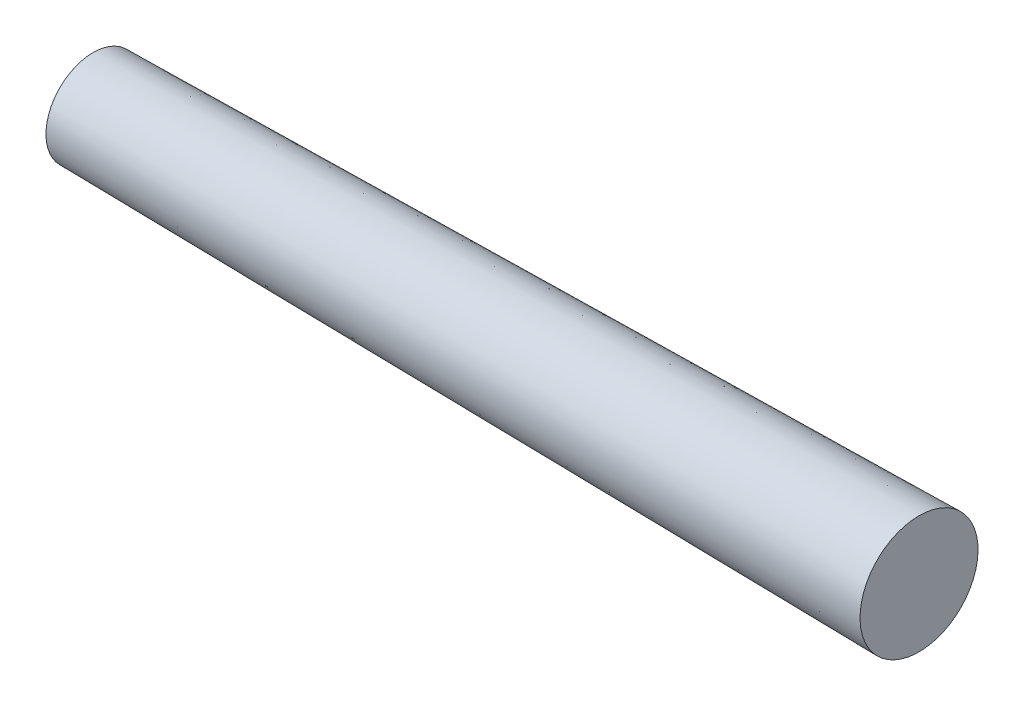
ISO-10303-21;
HEADER;
FILE_DESCRIPTION(('STEP AP214'),'2;1');
FILE_NAME('part.step','',(''),(''),'','','');
FILE_SCHEMA(('AUTOMOTIVE_DESIGN { 1 0 10303 214 1 1 1 1 }'));
ENDSEC;
DATA;
#1=APPLICATION_CONTEXT('core data for automotive mechanical design processes');
#2=APPLICATION_PROTOCOL_DEFINITION('international standard','automotive_design',2000,#1);
#3=PRODUCT_CONTEXT('',#1,'mechanical');
#4=PRODUCT('Part','Part','',(#3));
#5=PRODUCT_RELATED_PRODUCT_CATEGORY('part','',(#4));
#6=PRODUCT_DEFINITION_FORMATION('','',#4);
#7=PRODUCT_DEFINITION_CONTEXT('part definition',#1,'design');
#8=PRODUCT_DEFINITION('design','',#6,#7);
#9=PRODUCT_DEFINITION_SHAPE('','',#8);
#10=(LENGTH_UNIT() NAMED_UNIT(*) SI_UNIT(.MILLI.,.METRE.));
#11=(NAMED_UNIT(*) PLANE_ANGLE_UNIT() SI_UNIT($,.RADIAN.));
#12=(NAMED_UNIT(*) SI_UNIT($,.STERADIAN.) SOLID_ANGLE_UNIT());
#13=UNCERTAINTY_MEASURE_WITH_UNIT(LENGTH_MEASURE(1.E-05),#10,'distance_accuracy_value','');
#14=(GEOMETRIC_REPRESENTATION_CONTEXT(3) GLOBAL_UNCERTAINTY_ASSIGNED_CONTEXT((#13)) GLOBAL_UNIT_ASSIGNED_CONTEXT((#10,
#11,#12)) REPRESENTATION_CONTEXT('',''));
#15=CARTESIAN_POINT('',(0.,0.,0.));
#16=DIRECTION('',(0.,0.,1.));
#17=DIRECTION('',(1.,0.,0.));
#18=AXIS2_PLACEMENT_3D('',#15,#16,#17);
#19=CARTESIAN_POINT('',(0.,0.,0.));
#20=DIRECTION('',(-1.,0.,0.));
#21=DIRECTION('',(0.,-1.,0.));
#22=AXIS2_PLACEMENT_3D('',#19,#20,#21);
#23=PLANE('',#22);
#24=CARTESIAN_POINT('',(0.,0.,0.));
#25=DIRECTION('',(1.,0.,0.));
#26=DIRECTION('',(0.,1.,0.));
#27=AXIS2_PLACEMENT_3D('',#24,#25,#26);
#28=CIRCLE('',#27,2.);
#29=CARTESIAN_POINT('',(0.,2.,0.));
#30=VERTEX_POINT('',#29);
#31=EDGE_CURVE('E10',#30,#30,#28,.T.);
#32=ORIENTED_EDGE('',*,*,#31,.F.);
#33=EDGE_LOOP('',(#32));
#34=FACE_BOUND('',#33,.T.);
#35=ADVANCED_FACE('F37',(#34),#23,.T.);
#36=CARTESIAN_POINT('',(35.,0.,0.));
#37=DIRECTION('',(1.,0.,0.));
#38=DIRECTION('',(0.,1.,0.));
#39=AXIS2_PLACEMENT_3D('',#36,#37,#38);
#40=CONICAL_SURFACE('',#39,2.5,0.0142847425873966);
#41=ORIENTED_EDGE('',*,*,#31,.T.);
#42=EDGE_LOOP('',(#41));
#43=FACE_BOUND('',#42,.T.);
#44=CARTESIAN_POINT('',(35.,0.,0.));
#45=DIRECTION('',(1.,0.,0.));
#46=DIRECTION('',(0.,1.,0.));
#47=AXIS2_PLACEMENT_3D('',#44,#45,#46);
#48=CIRCLE('',#47,2.5);
#49=CARTESIAN_POINT('',(35.,2.5,0.));
#50=VERTEX_POINT('',#49);
#51=EDGE_CURVE('E44',#50,#50,#48,.T.);
#52=ORIENTED_EDGE('',*,*,#51,.F.);
#53=EDGE_LOOP('',(#52));
#54=FACE_BOUND('',#53,.T.);
#55=ADVANCED_FACE('F53',(#43,#54),#40,.T.);
#56=CARTESIAN_POINT('',(35.,2.5,0.));
#57=DIRECTION('',(1.,0.,0.));
#58=DIRECTION('',(0.,1.,0.));
#59=AXIS2_PLACEMENT_3D('',#56,#57,#58);
#60=PLANE('',#59);
#61=ORIENTED_EDGE('',*,*,#51,.T.);
#62=EDGE_LOOP('',(#61));
#63=FACE_BOUND('',#62,.T.);
#64=ADVANCED_FACE('F51',(#63),#60,.T.);
#65=CLOSED_SHELL('',(#35,#55,#64));
#66=MANIFOLD_SOLID_BREP('B2',#65);
#67=ADVANCED_BREP_SHAPE_REPRESENTATION('',(#18,#66),#14);
#68=SHAPE_DEFINITION_REPRESENTATION(#9,#67);
ENDSEC;
END-ISO-10303-21;
